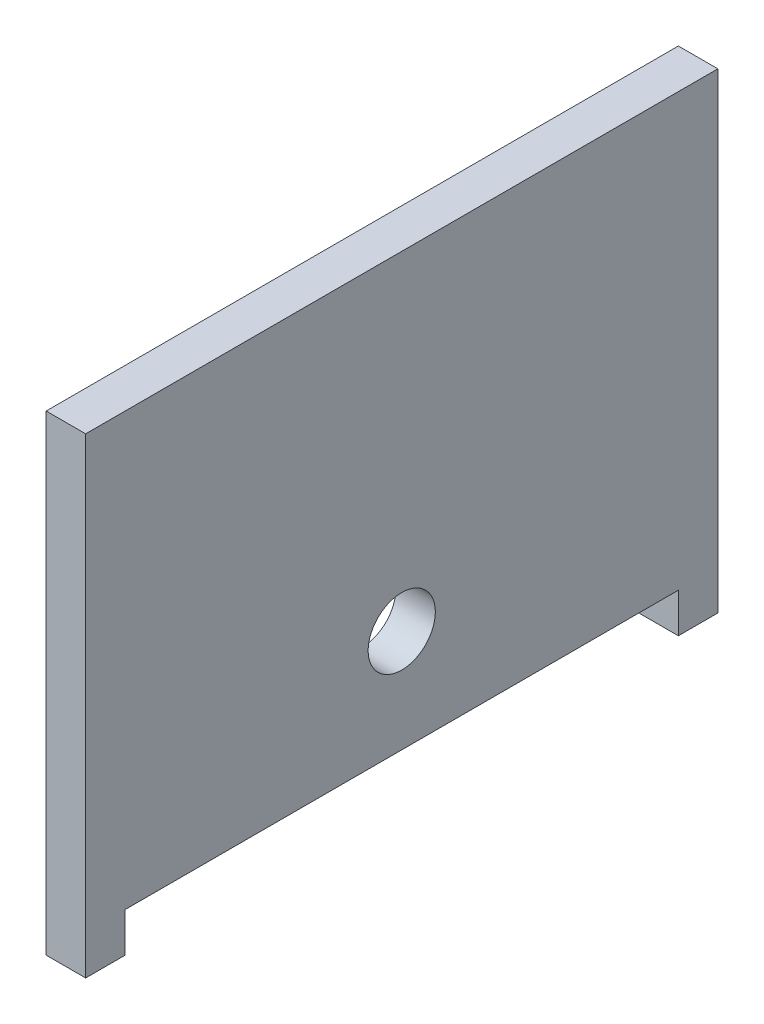
ISO-10303-21;
HEADER;
FILE_DESCRIPTION(('STEP AP214'),'2;1');
FILE_NAME('part.step','',(''),(''),'','','');
FILE_SCHEMA(('AUTOMOTIVE_DESIGN { 1 0 10303 214 1 1 1 1 }'));
ENDSEC;
DATA;
#1=APPLICATION_CONTEXT('core data for automotive mechanical design processes');
#2=APPLICATION_PROTOCOL_DEFINITION('international standard','automotive_design',2000,#1);
#3=PRODUCT_CONTEXT('',#1,'mechanical');
#4=PRODUCT('Part','Part','',(#3));
#5=PRODUCT_RELATED_PRODUCT_CATEGORY('part','',(#4));
#6=PRODUCT_DEFINITION_FORMATION('','',#4);
#7=PRODUCT_DEFINITION_CONTEXT('part definition',#1,'design');
#8=PRODUCT_DEFINITION('design','',#6,#7);
#9=PRODUCT_DEFINITION_SHAPE('','',#8);
#10=(LENGTH_UNIT() NAMED_UNIT(*) SI_UNIT(.MILLI.,.METRE.));
#11=(NAMED_UNIT(*) PLANE_ANGLE_UNIT() SI_UNIT($,.RADIAN.));
#12=(NAMED_UNIT(*) SI_UNIT($,.STERADIAN.) SOLID_ANGLE_UNIT());
#13=UNCERTAINTY_MEASURE_WITH_UNIT(LENGTH_MEASURE(1.E-05),#10,'distance_accuracy_value','');
#14=(GEOMETRIC_REPRESENTATION_CONTEXT(3) GLOBAL_UNCERTAINTY_ASSIGNED_CONTEXT((#13)) GLOBAL_UNIT_ASSIGNED_CONTEXT((#10,
#11,#12)) REPRESENTATION_CONTEXT('',''));
#15=CARTESIAN_POINT('',(0.,0.,0.));
#16=DIRECTION('',(0.,0.,1.));
#17=DIRECTION('',(1.,0.,0.));
#18=AXIS2_PLACEMENT_3D('',#15,#16,#17);
#19=CARTESIAN_POINT('',(-13.,7.72566611769187,160.));
#20=DIRECTION('',(0.,0.,1.));
#21=DIRECTION('',(0.,-1.,0.));
#22=AXIS2_PLACEMENT_3D('',#19,#20,#21);
#23=PLANE('',#22);
#24=DIRECTION('',(0.,-1.,0.));
#25=VECTOR('',#24,1.);
#26=CARTESIAN_POINT('',(-26.,-2.27433388230814,160.));
#27=LINE('',#26,#25);
#28=CARTESIAN_POINT('',(-26.,55.,160.));
#29=VERTEX_POINT('',#28);
#30=CARTESIAN_POINT('',(-26.,-64.2743338823082,160.));
#31=VERTEX_POINT('',#30);
#32=EDGE_CURVE('E199',#29,#31,#27,.T.);
#33=ORIENTED_EDGE('',*,*,#32,.F.);
#34=DIRECTION('',(1.,0.,0.));
#35=VECTOR('',#34,1.);
#36=CARTESIAN_POINT('',(-36.,55.,160.));
#37=LINE('',#36,#35);
#38=CARTESIAN_POINT('',(-36.,55.,160.));
#39=VERTEX_POINT('',#38);
#40=EDGE_CURVE('E145',#39,#29,#37,.T.);
#41=ORIENTED_EDGE('',*,*,#40,.F.);
#42=DIRECTION('',(0.,-1.,0.));
#43=VECTOR('',#42,1.);
#44=CARTESIAN_POINT('',(-36.,-2.27433388230815,160.));
#45=LINE('',#44,#43);
#46=CARTESIAN_POINT('',(-36.,-64.2743338823082,160.));
#47=VERTEX_POINT('',#46);
#48=EDGE_CURVE('E130',#39,#47,#45,.T.);
#49=ORIENTED_EDGE('',*,*,#48,.T.);
#50=DIRECTION('',(-1.,0.,0.));
#51=VECTOR('',#50,1.);
#52=CARTESIAN_POINT('',(-26.,-64.2743338823082,160.));
#53=LINE('',#52,#51);
#54=EDGE_CURVE('E163',#31,#47,#53,.T.);
#55=ORIENTED_EDGE('',*,*,#54,.F.);
#56=EDGE_LOOP('',(#33,#41,#49,#55));
#57=FACE_BOUND('',#56,.T.);
#58=ADVANCED_FACE('F45',(#57),#23,.T.);
#59=CARTESIAN_POINT('',(-36.,-2.27433388230815,160.));
#60=DIRECTION('',(1.,0.,0.));
#61=DIRECTION('',(0.,0.,1.));
#62=AXIS2_PLACEMENT_3D('',#59,#60,#61);
#63=PLANE('',#62);
#64=CARTESIAN_POINT('',(-36.,-28.2743338823081,80.));
#65=DIRECTION('',(-1.,0.,0.));
#66=DIRECTION('',(0.,0.,-1.));
#67=AXIS2_PLACEMENT_3D('',#64,#65,#66);
#68=CIRCLE('',#67,8.5);
#69=CARTESIAN_POINT('',(-36.,-28.2743338823081,71.5));
#70=VERTEX_POINT('',#69);
#71=EDGE_CURVE('E185',#70,#70,#68,.T.);
#72=ORIENTED_EDGE('',*,*,#71,.F.);
#73=EDGE_LOOP('',(#72));
#74=FACE_BOUND('',#73,.T.);
#75=DIRECTION('',(0.,-1.,0.));
#76=VECTOR('',#75,1.);
#77=CARTESIAN_POINT('',(-36.,-2.27433388230815,0.));
#78=LINE('',#77,#76);
#79=CARTESIAN_POINT('',(-36.,55.,0.));
#80=VERTEX_POINT('',#79);
#81=CARTESIAN_POINT('',(-36.,-64.2743338823081,0.));
#82=VERTEX_POINT('',#81);
#83=EDGE_CURVE('E112',#80,#82,#78,.T.);
#84=ORIENTED_EDGE('',*,*,#83,.T.);
#85=DIRECTION('',(0.,0.,1.));
#86=VECTOR('',#85,1.);
#87=CARTESIAN_POINT('',(-36.,-64.2743338823081,0.));
#88=LINE('',#87,#86);
#89=CARTESIAN_POINT('',(-36.,-64.2743338823081,10.));
#90=VERTEX_POINT('',#89);
#91=EDGE_CURVE('E167',#82,#90,#88,.T.);
#92=ORIENTED_EDGE('',*,*,#91,.T.);
#93=DIRECTION('',(0.,1.,0.));
#94=VECTOR('',#93,1.);
#95=CARTESIAN_POINT('',(-36.,-64.2743338823081,10.));
#96=LINE('',#95,#94);
#97=CARTESIAN_POINT('',(-36.,-54.2743338823081,10.));
#98=VERTEX_POINT('',#97);
#99=EDGE_CURVE('E178',#90,#98,#96,.T.);
#100=ORIENTED_EDGE('',*,*,#99,.T.);
#101=DIRECTION('',(0.,0.,-1.));
#102=VECTOR('',#101,1.);
#103=CARTESIAN_POINT('',(-36.,-54.2743338823081,160.));
#104=LINE('',#103,#102);
#105=CARTESIAN_POINT('',(-36.,-54.2743338823081,150.));
#106=VERTEX_POINT('',#105);
#107=EDGE_CURVE('E12',#106,#98,#104,.T.);
#108=ORIENTED_EDGE('',*,*,#107,.F.);
#109=DIRECTION('',(0.,-1.,0.));
#110=VECTOR('',#109,1.);
#111=CARTESIAN_POINT('',(-36.,-64.2743338823082,150.));
#112=LINE('',#111,#110);
#113=CARTESIAN_POINT('',(-36.,-64.2743338823082,150.));
#114=VERTEX_POINT('',#113);
#115=EDGE_CURVE('E135',#106,#114,#112,.T.);
#116=ORIENTED_EDGE('',*,*,#115,.T.);
#117=DIRECTION('',(0.,0.,1.));
#118=VECTOR('',#117,1.);
#119=CARTESIAN_POINT('',(-36.,-64.2743338823082,160.));
#120=LINE('',#119,#118);
#121=EDGE_CURVE('E153',#114,#47,#120,.T.);
#122=ORIENTED_EDGE('',*,*,#121,.T.);
#123=ORIENTED_EDGE('',*,*,#48,.F.);
#124=DIRECTION('',(0.,0.,-1.));
#125=VECTOR('',#124,1.);
#126=CARTESIAN_POINT('',(-36.,55.,160.));
#127=LINE('',#126,#125);
#128=EDGE_CURVE('E127',#39,#80,#127,.T.);
#129=ORIENTED_EDGE('',*,*,#128,.T.);
#130=EDGE_LOOP('',(#84,#92,#100,#108,#116,#122,#123,#129));
#131=FACE_BOUND('',#130,.T.);
#132=ADVANCED_FACE('F128',(#74,#131),#63,.F.);
#133=CARTESIAN_POINT('',(-26.,-54.2743338823081,160.));
#134=DIRECTION('',(0.,-1.,0.));
#135=DIRECTION('',(0.,0.,-1.));
#136=AXIS2_PLACEMENT_3D('',#133,#134,#135);
#137=PLANE('',#136);
#138=DIRECTION('',(-1.,0.,0.));
#139=VECTOR('',#138,1.);
#140=CARTESIAN_POINT('',(-26.,-54.2743338823081,150.));
#141=LINE('',#140,#139);
#142=CARTESIAN_POINT('',(-26.,-54.2743338823081,150.));
#143=VERTEX_POINT('',#142);
#144=EDGE_CURVE('E157',#143,#106,#141,.T.);
#145=ORIENTED_EDGE('',*,*,#144,.T.);
#146=ORIENTED_EDGE('',*,*,#107,.T.);
#147=DIRECTION('',(-1.,0.,0.));
#148=VECTOR('',#147,1.);
#149=CARTESIAN_POINT('',(-26.,-54.2743338823081,10.));
#150=LINE('',#149,#148);
#151=CARTESIAN_POINT('',(-26.,-54.2743338823081,10.));
#152=VERTEX_POINT('',#151);
#153=EDGE_CURVE('E181',#152,#98,#150,.T.);
#154=ORIENTED_EDGE('',*,*,#153,.F.);
#155=DIRECTION('',(0.,0.,-1.));
#156=VECTOR('',#155,1.);
#157=CARTESIAN_POINT('',(-26.,-54.2743338823081,160.));
#158=LINE('',#157,#156);
#159=EDGE_CURVE('E55',#143,#152,#158,.T.);
#160=ORIENTED_EDGE('',*,*,#159,.F.);
#161=EDGE_LOOP('',(#145,#146,#154,#160));
#162=FACE_BOUND('',#161,.T.);
#163=ADVANCED_FACE('F214',(#162),#137,.T.);
#164=CARTESIAN_POINT('',(-26.,55.,160.));
#165=DIRECTION('',(1.,0.,0.));
#166=DIRECTION('',(0.,1.,0.));
#167=AXIS2_PLACEMENT_3D('',#164,#165,#166);
#168=PLANE('',#167);
#169=CARTESIAN_POINT('',(-26.,-28.2743338823081,80.));
#170=DIRECTION('',(-1.,0.,0.));
#171=DIRECTION('',(0.,0.,-1.));
#172=AXIS2_PLACEMENT_3D('',#169,#170,#171);
#173=CIRCLE('',#172,8.5);
#174=CARTESIAN_POINT('',(-26.,-28.2743338823081,71.5));
#175=VERTEX_POINT('',#174);
#176=EDGE_CURVE('E124',#175,#175,#173,.T.);
#177=ORIENTED_EDGE('',*,*,#176,.T.);
#178=EDGE_LOOP('',(#177));
#179=FACE_BOUND('',#178,.T.);
#180=DIRECTION('',(0.,-1.,0.));
#181=VECTOR('',#180,1.);
#182=CARTESIAN_POINT('',(-26.,-2.27433388230814,0.));
#183=LINE('',#182,#181);
#184=CARTESIAN_POINT('',(-26.,55.,0.));
#185=VERTEX_POINT('',#184);
#186=CARTESIAN_POINT('',(-26.,-64.2743338823081,0.));
#187=VERTEX_POINT('',#186);
#188=EDGE_CURVE('E123',#185,#187,#183,.T.);
#189=ORIENTED_EDGE('',*,*,#188,.F.);
#190=DIRECTION('',(0.,0.,-1.));
#191=VECTOR('',#190,1.);
#192=CARTESIAN_POINT('',(-26.,55.,160.));
#193=LINE('',#192,#191);
#194=EDGE_CURVE('E140',#29,#185,#193,.T.);
#195=ORIENTED_EDGE('',*,*,#194,.F.);
#196=ORIENTED_EDGE('',*,*,#32,.T.);
#197=DIRECTION('',(0.,0.,1.));
#198=VECTOR('',#197,1.);
#199=CARTESIAN_POINT('',(-26.,-64.2743338823082,160.));
#200=LINE('',#199,#198);
#201=CARTESIAN_POINT('',(-26.,-64.2743338823082,150.));
#202=VERTEX_POINT('',#201);
#203=EDGE_CURVE('E152',#202,#31,#200,.T.);
#204=ORIENTED_EDGE('',*,*,#203,.F.);
#205=DIRECTION('',(0.,-1.,0.));
#206=VECTOR('',#205,1.);
#207=CARTESIAN_POINT('',(-26.,-64.2743338823082,150.));
#208=LINE('',#207,#206);
#209=EDGE_CURVE('E63',#143,#202,#208,.T.);
#210=ORIENTED_EDGE('',*,*,#209,.F.);
#211=ORIENTED_EDGE('',*,*,#159,.T.);
#212=DIRECTION('',(0.,1.,0.));
#213=VECTOR('',#212,1.);
#214=CARTESIAN_POINT('',(-26.,-64.2743338823081,10.));
#215=LINE('',#214,#213);
#216=CARTESIAN_POINT('',(-26.,-64.2743338823081,10.));
#217=VERTEX_POINT('',#216);
#218=EDGE_CURVE('E49',#217,#152,#215,.T.);
#219=ORIENTED_EDGE('',*,*,#218,.F.);
#220=DIRECTION('',(0.,0.,1.));
#221=VECTOR('',#220,1.);
#222=CARTESIAN_POINT('',(-26.,-64.2743338823081,0.));
#223=LINE('',#222,#221);
#224=EDGE_CURVE('E174',#187,#217,#223,.T.);
#225=ORIENTED_EDGE('',*,*,#224,.F.);
#226=EDGE_LOOP('',(#189,#195,#196,#204,#210,#211,#219,#225));
#227=FACE_BOUND('',#226,.T.);
#228=ADVANCED_FACE('F47',(#179,#227),#168,.T.);
#229=CARTESIAN_POINT('',(-13.,-15.2743338823081,0.));
#230=DIRECTION('',(0.,0.,-1.));
#231=DIRECTION('',(0.,1.,0.));
#232=AXIS2_PLACEMENT_3D('',#229,#230,#231);
#233=PLANE('',#232);
#234=ORIENTED_EDGE('',*,*,#83,.F.);
#235=DIRECTION('',(1.,0.,0.));
#236=VECTOR('',#235,1.);
#237=CARTESIAN_POINT('',(-36.,55.,0.));
#238=LINE('',#237,#236);
#239=EDGE_CURVE('E116',#80,#185,#238,.T.);
#240=ORIENTED_EDGE('',*,*,#239,.T.);
#241=ORIENTED_EDGE('',*,*,#188,.T.);
#242=DIRECTION('',(-1.,0.,0.));
#243=VECTOR('',#242,1.);
#244=CARTESIAN_POINT('',(-26.,-64.2743338823081,0.));
#245=LINE('',#244,#243);
#246=EDGE_CURVE('E118',#187,#82,#245,.T.);
#247=ORIENTED_EDGE('',*,*,#246,.T.);
#248=EDGE_LOOP('',(#234,#240,#241,#247));
#249=FACE_BOUND('',#248,.T.);
#250=ADVANCED_FACE('F114',(#249),#233,.T.);
#251=CARTESIAN_POINT('',(-26.,-28.2743338823081,80.));
#252=DIRECTION('',(-1.,0.,0.));
#253=DIRECTION('',(0.,0.,-1.));
#254=AXIS2_PLACEMENT_3D('',#251,#252,#253);
#255=CYLINDRICAL_SURFACE('',#254,8.5);
#256=ORIENTED_EDGE('',*,*,#176,.F.);
#257=EDGE_LOOP('',(#256));
#258=FACE_BOUND('',#257,.T.);
#259=ORIENTED_EDGE('',*,*,#71,.T.);
#260=EDGE_LOOP('',(#259));
#261=FACE_BOUND('',#260,.T.);
#262=ADVANCED_FACE('F246',(#258,#261),#255,.F.);
#263=CARTESIAN_POINT('',(-26.,-64.2743338823081,10.));
#264=DIRECTION('',(0.,0.,1.));
#265=DIRECTION('',(0.,-1.,0.));
#266=AXIS2_PLACEMENT_3D('',#263,#264,#265);
#267=PLANE('',#266);
#268=ORIENTED_EDGE('',*,*,#99,.F.);
#269=DIRECTION('',(-1.,0.,0.));
#270=VECTOR('',#269,1.);
#271=CARTESIAN_POINT('',(-26.,-64.2743338823081,10.));
#272=LINE('',#271,#270);
#273=EDGE_CURVE('E186',#217,#90,#272,.T.);
#274=ORIENTED_EDGE('',*,*,#273,.F.);
#275=ORIENTED_EDGE('',*,*,#218,.T.);
#276=ORIENTED_EDGE('',*,*,#153,.T.);
#277=EDGE_LOOP('',(#268,#274,#275,#276));
#278=FACE_BOUND('',#277,.T.);
#279=ADVANCED_FACE('F211',(#278),#267,.T.);
#280=CARTESIAN_POINT('',(-26.,-64.2743338823081,0.));
#281=DIRECTION('',(0.,-1.,0.));
#282=DIRECTION('',(0.,0.,-1.));
#283=AXIS2_PLACEMENT_3D('',#280,#281,#282);
#284=PLANE('',#283);
#285=ORIENTED_EDGE('',*,*,#91,.F.);
#286=ORIENTED_EDGE('',*,*,#246,.F.);
#287=ORIENTED_EDGE('',*,*,#224,.T.);
#288=ORIENTED_EDGE('',*,*,#273,.T.);
#289=EDGE_LOOP('',(#285,#286,#287,#288));
#290=FACE_BOUND('',#289,.T.);
#291=ADVANCED_FACE('F224',(#290),#284,.T.);
#292=CARTESIAN_POINT('',(-26.,-64.2743338823082,160.));
#293=DIRECTION('',(0.,-1.,0.));
#294=DIRECTION('',(0.,0.,-1.));
#295=AXIS2_PLACEMENT_3D('',#292,#293,#294);
#296=PLANE('',#295);
#297=ORIENTED_EDGE('',*,*,#121,.F.);
#298=DIRECTION('',(-1.,0.,0.));
#299=VECTOR('',#298,1.);
#300=CARTESIAN_POINT('',(-26.,-64.2743338823082,150.));
#301=LINE('',#300,#299);
#302=EDGE_CURVE('E168',#202,#114,#301,.T.);
#303=ORIENTED_EDGE('',*,*,#302,.F.);
#304=ORIENTED_EDGE('',*,*,#203,.T.);
#305=ORIENTED_EDGE('',*,*,#54,.T.);
#306=EDGE_LOOP('',(#297,#303,#304,#305));
#307=FACE_BOUND('',#306,.T.);
#308=ADVANCED_FACE('F219',(#307),#296,.T.);
#309=CARTESIAN_POINT('',(-26.,-64.2743338823082,150.));
#310=DIRECTION('',(0.,0.,-1.));
#311=DIRECTION('',(0.,1.,0.));
#312=AXIS2_PLACEMENT_3D('',#309,#310,#311);
#313=PLANE('',#312);
#314=ORIENTED_EDGE('',*,*,#115,.F.);
#315=ORIENTED_EDGE('',*,*,#144,.F.);
#316=ORIENTED_EDGE('',*,*,#209,.T.);
#317=ORIENTED_EDGE('',*,*,#302,.T.);
#318=EDGE_LOOP('',(#314,#315,#316,#317));
#319=FACE_BOUND('',#318,.T.);
#320=ADVANCED_FACE('F216',(#319),#313,.T.);
#321=CARTESIAN_POINT('',(-36.,55.,160.));
#322=DIRECTION('',(0.,1.,0.));
#323=DIRECTION('',(0.,0.,1.));
#324=AXIS2_PLACEMENT_3D('',#321,#322,#323);
#325=PLANE('',#324);
#326=ORIENTED_EDGE('',*,*,#239,.F.);
#327=ORIENTED_EDGE('',*,*,#128,.F.);
#328=ORIENTED_EDGE('',*,*,#40,.T.);
#329=ORIENTED_EDGE('',*,*,#194,.T.);
#330=EDGE_LOOP('',(#326,#327,#328,#329));
#331=FACE_BOUND('',#330,.T.);
#332=ADVANCED_FACE('F138',(#331),#325,.T.);
#333=CLOSED_SHELL('',(#58,#132,#163,#228,#250,#262,#279,#291,#308,#320,#332));
#334=MANIFOLD_SOLID_BREP('B2',#333);
#335=ADVANCED_BREP_SHAPE_REPRESENTATION('',(#18,#334),#14);
#336=SHAPE_DEFINITION_REPRESENTATION(#9,#335);
ENDSEC;
END-ISO-10303-21;
